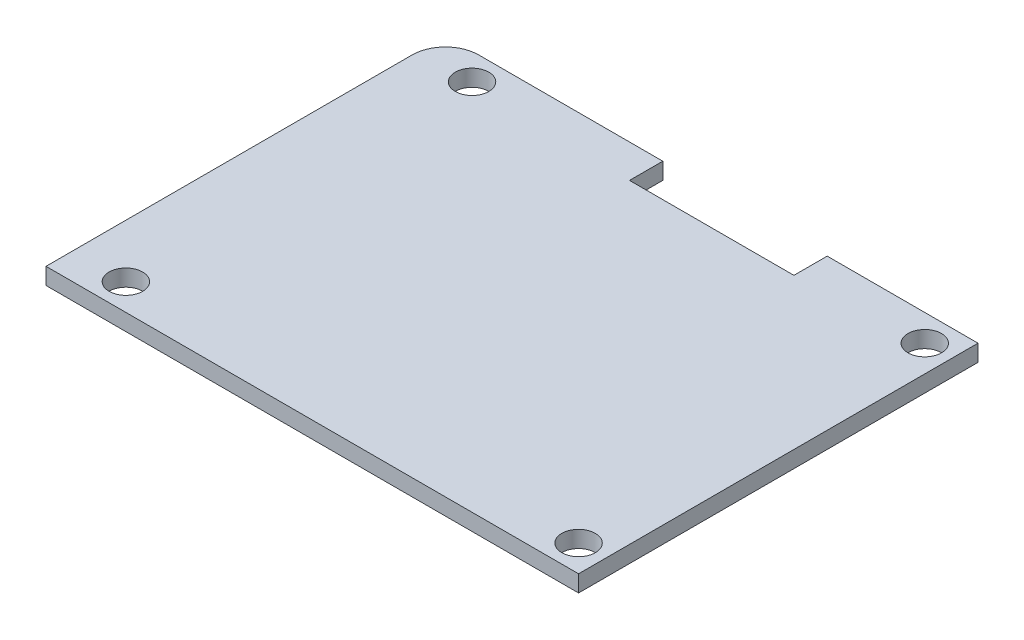
ISO-10303-21;
HEADER;
FILE_DESCRIPTION(('STEP AP214'),'2;1');
FILE_NAME('part.step','',(''),(''),'','','');
FILE_SCHEMA(('AUTOMOTIVE_DESIGN { 1 0 10303 214 1 1 1 1 }'));
ENDSEC;
DATA;
#1=APPLICATION_CONTEXT('core data for automotive mechanical design processes');
#2=APPLICATION_PROTOCOL_DEFINITION('international standard','automotive_design',2000,#1);
#3=PRODUCT_CONTEXT('',#1,'mechanical');
#4=PRODUCT('Part','Part','',(#3));
#5=PRODUCT_RELATED_PRODUCT_CATEGORY('part','',(#4));
#6=PRODUCT_DEFINITION_FORMATION('','',#4);
#7=PRODUCT_DEFINITION_CONTEXT('part definition',#1,'design');
#8=PRODUCT_DEFINITION('design','',#6,#7);
#9=PRODUCT_DEFINITION_SHAPE('','',#8);
#10=(LENGTH_UNIT() NAMED_UNIT(*) SI_UNIT(.MILLI.,.METRE.));
#11=(NAMED_UNIT(*) PLANE_ANGLE_UNIT() SI_UNIT($,.RADIAN.));
#12=(NAMED_UNIT(*) SI_UNIT($,.STERADIAN.) SOLID_ANGLE_UNIT());
#13=UNCERTAINTY_MEASURE_WITH_UNIT(LENGTH_MEASURE(1.E-05),#10,'distance_accuracy_value','');
#14=(GEOMETRIC_REPRESENTATION_CONTEXT(3) GLOBAL_UNCERTAINTY_ASSIGNED_CONTEXT((#13)) GLOBAL_UNIT_ASSIGNED_CONTEXT((#10,
#11,#12)) REPRESENTATION_CONTEXT('',''));
#15=CARTESIAN_POINT('',(0.,0.,0.));
#16=DIRECTION('',(0.,0.,1.));
#17=DIRECTION('',(1.,0.,0.));
#18=AXIS2_PLACEMENT_3D('',#15,#16,#17);
#19=CARTESIAN_POINT('',(0.,1.5875,0.));
#20=DIRECTION('',(1.,0.,0.));
#21=DIRECTION('',(0.,0.,-1.));
#22=AXIS2_PLACEMENT_3D('',#19,#20,#21);
#23=PLANE('',#22);
#24=DIRECTION('',(0.,0.,1.));
#25=VECTOR('',#24,1.);
#26=CARTESIAN_POINT('',(0.,1.5875,0.));
#27=LINE('',#26,#25);
#28=CARTESIAN_POINT('',(0.,1.5875,-34.925));
#29=VERTEX_POINT('',#28);
#30=CARTESIAN_POINT('',(0.,1.5875,0.));
#31=VERTEX_POINT('',#30);
#32=EDGE_CURVE('E103',#29,#31,#27,.T.);
#33=ORIENTED_EDGE('',*,*,#32,.F.);
#34=DIRECTION('',(0.,-1.,0.));
#35=VECTOR('',#34,1.);
#36=CARTESIAN_POINT('',(0.,1.5875,-34.925));
#37=LINE('',#36,#35);
#38=CARTESIAN_POINT('',(0.,0.,-34.925));
#39=VERTEX_POINT('',#38);
#40=EDGE_CURVE('E126',#29,#39,#37,.T.);
#41=ORIENTED_EDGE('',*,*,#40,.T.);
#42=DIRECTION('',(0.,0.,1.));
#43=VECTOR('',#42,1.);
#44=CARTESIAN_POINT('',(0.,0.,0.));
#45=LINE('',#44,#43);
#46=CARTESIAN_POINT('',(0.,0.,0.));
#47=VERTEX_POINT('',#46);
#48=EDGE_CURVE('E124',#39,#47,#45,.T.);
#49=ORIENTED_EDGE('',*,*,#48,.T.);
#50=DIRECTION('',(0.,-1.,0.));
#51=VECTOR('',#50,1.);
#52=CARTESIAN_POINT('',(0.,1.5875,0.));
#53=LINE('',#52,#51);
#54=EDGE_CURVE('E118',#31,#47,#53,.T.);
#55=ORIENTED_EDGE('',*,*,#54,.F.);
#56=EDGE_LOOP('',(#33,#41,#49,#55));
#57=FACE_BOUND('',#56,.T.);
#58=ADVANCED_FACE('F33',(#57),#23,.F.);
#59=CARTESIAN_POINT('',(0.,1.5875,0.));
#60=DIRECTION('',(0.,0.,-1.));
#61=DIRECTION('',(-1.,0.,0.));
#62=AXIS2_PLACEMENT_3D('',#59,#60,#61);
#63=PLANE('',#62);
#64=DIRECTION('',(1.,0.,0.));
#65=VECTOR('',#64,1.);
#66=CARTESIAN_POINT('',(0.,0.,0.));
#67=LINE('',#66,#65);
#68=CARTESIAN_POINT('',(50.8,0.,0.));
#69=VERTEX_POINT('',#68);
#70=EDGE_CURVE('E159',#47,#69,#67,.T.);
#71=ORIENTED_EDGE('',*,*,#70,.T.);
#72=DIRECTION('',(0.,-1.,0.));
#73=VECTOR('',#72,1.);
#74=CARTESIAN_POINT('',(50.8,1.5875,0.));
#75=LINE('',#74,#73);
#76=CARTESIAN_POINT('',(50.8,1.5875,0.));
#77=VERTEX_POINT('',#76);
#78=EDGE_CURVE('E120',#77,#69,#75,.T.);
#79=ORIENTED_EDGE('',*,*,#78,.F.);
#80=DIRECTION('',(1.,0.,0.));
#81=VECTOR('',#80,1.);
#82=CARTESIAN_POINT('',(0.,1.5875,0.));
#83=LINE('',#82,#81);
#84=EDGE_CURVE('E106',#31,#77,#83,.T.);
#85=ORIENTED_EDGE('',*,*,#84,.F.);
#86=ORIENTED_EDGE('',*,*,#54,.T.);
#87=EDGE_LOOP('',(#71,#79,#85,#86));
#88=FACE_BOUND('',#87,.T.);
#89=ADVANCED_FACE('F117',(#88),#63,.F.);
#90=CARTESIAN_POINT('',(50.8,1.5875,0.));
#91=DIRECTION('',(-1.,0.,0.));
#92=DIRECTION('',(0.,0.,1.));
#93=AXIS2_PLACEMENT_3D('',#90,#91,#92);
#94=PLANE('',#93);
#95=DIRECTION('',(0.,0.,-1.));
#96=VECTOR('',#95,1.);
#97=CARTESIAN_POINT('',(50.8,0.,0.));
#98=LINE('',#97,#96);
#99=CARTESIAN_POINT('',(50.8,0.,-38.1));
#100=VERTEX_POINT('',#99);
#101=EDGE_CURVE('E157',#69,#100,#98,.T.);
#102=ORIENTED_EDGE('',*,*,#101,.T.);
#103=DIRECTION('',(0.,-1.,0.));
#104=VECTOR('',#103,1.);
#105=CARTESIAN_POINT('',(50.8,1.5875,-38.1));
#106=LINE('',#105,#104);
#107=CARTESIAN_POINT('',(50.8,1.5875,-38.1));
#108=VERTEX_POINT('',#107);
#109=EDGE_CURVE('E129',#108,#100,#106,.T.);
#110=ORIENTED_EDGE('',*,*,#109,.F.);
#111=DIRECTION('',(0.,0.,-1.));
#112=VECTOR('',#111,1.);
#113=CARTESIAN_POINT('',(50.8,1.5875,0.));
#114=LINE('',#113,#112);
#115=EDGE_CURVE('E122',#77,#108,#114,.T.);
#116=ORIENTED_EDGE('',*,*,#115,.F.);
#117=ORIENTED_EDGE('',*,*,#78,.T.);
#118=EDGE_LOOP('',(#102,#110,#116,#117));
#119=FACE_BOUND('',#118,.T.);
#120=ADVANCED_FACE('F234',(#119),#94,.F.);
#121=CARTESIAN_POINT('',(36.41598,1.5875,-38.1));
#122=DIRECTION('',(0.,0.,1.));
#123=DIRECTION('',(1.,0.,0.));
#124=AXIS2_PLACEMENT_3D('',#121,#122,#123);
#125=PLANE('',#124);
#126=DIRECTION('',(-1.,0.,0.));
#127=VECTOR('',#126,1.);
#128=CARTESIAN_POINT('',(36.41598,0.,-38.1));
#129=LINE('',#128,#127);
#130=CARTESIAN_POINT('',(36.41598,0.,-38.1));
#131=VERTEX_POINT('',#130);
#132=EDGE_CURVE('E155',#100,#131,#129,.T.);
#133=ORIENTED_EDGE('',*,*,#132,.T.);
#134=DIRECTION('',(0.,-1.,0.));
#135=VECTOR('',#134,1.);
#136=CARTESIAN_POINT('',(36.41598,1.5875,-38.1));
#137=LINE('',#136,#135);
#138=CARTESIAN_POINT('',(36.41598,1.5875,-38.1));
#139=VERTEX_POINT('',#138);
#140=EDGE_CURVE('E135',#139,#131,#137,.T.);
#141=ORIENTED_EDGE('',*,*,#140,.F.);
#142=DIRECTION('',(-1.,0.,0.));
#143=VECTOR('',#142,1.);
#144=CARTESIAN_POINT('',(36.41598,1.5875,-38.1));
#145=LINE('',#144,#143);
#146=EDGE_CURVE('E170',#108,#139,#145,.T.);
#147=ORIENTED_EDGE('',*,*,#146,.F.);
#148=ORIENTED_EDGE('',*,*,#109,.T.);
#149=EDGE_LOOP('',(#133,#141,#147,#148));
#150=FACE_BOUND('',#149,.T.);
#151=ADVANCED_FACE('F239',(#150),#125,.F.);
#152=CARTESIAN_POINT('',(36.41598,1.5875,-38.1));
#153=DIRECTION('',(1.,0.,0.));
#154=DIRECTION('',(0.,0.,-1.));
#155=AXIS2_PLACEMENT_3D('',#152,#153,#154);
#156=PLANE('',#155);
#157=DIRECTION('',(0.,0.,1.));
#158=VECTOR('',#157,1.);
#159=CARTESIAN_POINT('',(36.41598,0.,-38.1));
#160=LINE('',#159,#158);
#161=CARTESIAN_POINT('',(36.41598,0.,-34.925));
#162=VERTEX_POINT('',#161);
#163=EDGE_CURVE('E153',#131,#162,#160,.T.);
#164=ORIENTED_EDGE('',*,*,#163,.T.);
#165=DIRECTION('',(0.,-1.,0.));
#166=VECTOR('',#165,1.);
#167=CARTESIAN_POINT('',(36.41598,1.5875,-34.925));
#168=LINE('',#167,#166);
#169=CARTESIAN_POINT('',(36.41598,1.5875,-34.925));
#170=VERTEX_POINT('',#169);
#171=EDGE_CURVE('E138',#170,#162,#168,.T.);
#172=ORIENTED_EDGE('',*,*,#171,.F.);
#173=DIRECTION('',(0.,0.,1.));
#174=VECTOR('',#173,1.);
#175=CARTESIAN_POINT('',(36.41598,1.5875,-38.1));
#176=LINE('',#175,#174);
#177=EDGE_CURVE('E168',#139,#170,#176,.T.);
#178=ORIENTED_EDGE('',*,*,#177,.F.);
#179=ORIENTED_EDGE('',*,*,#140,.T.);
#180=EDGE_LOOP('',(#164,#172,#178,#179));
#181=FACE_BOUND('',#180,.T.);
#182=ADVANCED_FACE('F243',(#181),#156,.F.);
#183=CARTESIAN_POINT('',(20.73402,1.5875,-34.925));
#184=DIRECTION('',(0.,0.,1.));
#185=DIRECTION('',(1.,0.,0.));
#186=AXIS2_PLACEMENT_3D('',#183,#184,#185);
#187=PLANE('',#186);
#188=DIRECTION('',(-1.,0.,0.));
#189=VECTOR('',#188,1.);
#190=CARTESIAN_POINT('',(20.73402,0.,-34.925));
#191=LINE('',#190,#189);
#192=CARTESIAN_POINT('',(20.73402,0.,-34.925));
#193=VERTEX_POINT('',#192);
#194=EDGE_CURVE('E151',#162,#193,#191,.T.);
#195=ORIENTED_EDGE('',*,*,#194,.T.);
#196=DIRECTION('',(0.,-1.,0.));
#197=VECTOR('',#196,1.);
#198=CARTESIAN_POINT('',(20.73402,1.5875,-34.925));
#199=LINE('',#198,#197);
#200=CARTESIAN_POINT('',(20.73402,1.5875,-34.925));
#201=VERTEX_POINT('',#200);
#202=EDGE_CURVE('E141',#201,#193,#199,.T.);
#203=ORIENTED_EDGE('',*,*,#202,.F.);
#204=DIRECTION('',(-1.,0.,0.));
#205=VECTOR('',#204,1.);
#206=CARTESIAN_POINT('',(20.73402,1.5875,-34.925));
#207=LINE('',#206,#205);
#208=EDGE_CURVE('E166',#170,#201,#207,.T.);
#209=ORIENTED_EDGE('',*,*,#208,.F.);
#210=ORIENTED_EDGE('',*,*,#171,.T.);
#211=EDGE_LOOP('',(#195,#203,#209,#210));
#212=FACE_BOUND('',#211,.T.);
#213=ADVANCED_FACE('F247',(#212),#187,.F.);
#214=CARTESIAN_POINT('',(20.73402,1.5875,-38.1));
#215=DIRECTION('',(-1.,0.,0.));
#216=DIRECTION('',(0.,0.,1.));
#217=AXIS2_PLACEMENT_3D('',#214,#215,#216);
#218=PLANE('',#217);
#219=DIRECTION('',(0.,0.,-1.));
#220=VECTOR('',#219,1.);
#221=CARTESIAN_POINT('',(20.73402,0.,-38.1));
#222=LINE('',#221,#220);
#223=CARTESIAN_POINT('',(20.73402,0.,-38.1));
#224=VERTEX_POINT('',#223);
#225=EDGE_CURVE('E149',#193,#224,#222,.T.);
#226=ORIENTED_EDGE('',*,*,#225,.T.);
#227=DIRECTION('',(0.,-1.,0.));
#228=VECTOR('',#227,1.);
#229=CARTESIAN_POINT('',(20.73402,1.5875,-38.1));
#230=LINE('',#229,#228);
#231=CARTESIAN_POINT('',(20.73402,1.5875,-38.1));
#232=VERTEX_POINT('',#231);
#233=EDGE_CURVE('E144',#232,#224,#230,.T.);
#234=ORIENTED_EDGE('',*,*,#233,.F.);
#235=DIRECTION('',(0.,0.,-1.));
#236=VECTOR('',#235,1.);
#237=CARTESIAN_POINT('',(20.73402,1.5875,-38.1));
#238=LINE('',#237,#236);
#239=EDGE_CURVE('E164',#201,#232,#238,.T.);
#240=ORIENTED_EDGE('',*,*,#239,.F.);
#241=ORIENTED_EDGE('',*,*,#202,.T.);
#242=EDGE_LOOP('',(#226,#234,#240,#241));
#243=FACE_BOUND('',#242,.T.);
#244=ADVANCED_FACE('F251',(#243),#218,.F.);
#245=CARTESIAN_POINT('',(0.,1.5875,-38.1));
#246=DIRECTION('',(0.,0.,1.));
#247=DIRECTION('',(1.,0.,0.));
#248=AXIS2_PLACEMENT_3D('',#245,#246,#247);
#249=PLANE('',#248);
#250=DIRECTION('',(-1.,0.,0.));
#251=VECTOR('',#250,1.);
#252=CARTESIAN_POINT('',(0.,0.,-38.1));
#253=LINE('',#252,#251);
#254=CARTESIAN_POINT('',(3.175,0.,-38.1));
#255=VERTEX_POINT('',#254);
#256=EDGE_CURVE('E113',#224,#255,#253,.T.);
#257=ORIENTED_EDGE('',*,*,#256,.T.);
#258=DIRECTION('',(0.,-1.,0.));
#259=VECTOR('',#258,1.);
#260=CARTESIAN_POINT('',(3.175,1.5875,-38.1));
#261=LINE('',#260,#259);
#262=CARTESIAN_POINT('',(3.175,1.5875,-38.1));
#263=VERTEX_POINT('',#262);
#264=EDGE_CURVE('E41',#255,#263,#261,.F.);
#265=ORIENTED_EDGE('',*,*,#264,.T.);
#266=DIRECTION('',(-1.,0.,0.));
#267=VECTOR('',#266,1.);
#268=CARTESIAN_POINT('',(0.,1.5875,-38.1));
#269=LINE('',#268,#267);
#270=EDGE_CURVE('E147',#232,#263,#269,.T.);
#271=ORIENTED_EDGE('',*,*,#270,.F.);
#272=ORIENTED_EDGE('',*,*,#233,.T.);
#273=EDGE_LOOP('',(#257,#265,#271,#272));
#274=FACE_BOUND('',#273,.T.);
#275=ADVANCED_FACE('F210',(#274),#249,.F.);
#276=CARTESIAN_POINT('',(0.,1.5875,0.));
#277=DIRECTION('',(0.,-1.,0.));
#278=DIRECTION('',(0.,0.,-1.));
#279=AXIS2_PLACEMENT_3D('',#276,#277,#278);
#280=PLANE('',#279);
#281=CARTESIAN_POINT('',(5.08,1.5875,-2.54));
#282=DIRECTION('',(0.,1.,0.));
#283=DIRECTION('',(0.,0.,1.));
#284=AXIS2_PLACEMENT_3D('',#281,#282,#283);
#285=CIRCLE('',#284,1.599999975);
#286=CARTESIAN_POINT('',(5.08,1.5875,-0.940000025000001));
#287=VERTEX_POINT('',#286);
#288=EDGE_CURVE('E185',#287,#287,#285,.T.);
#289=ORIENTED_EDGE('',*,*,#288,.F.);
#290=EDGE_LOOP('',(#289));
#291=FACE_BOUND('',#290,.T.);
#292=CARTESIAN_POINT('',(48.26,1.5875,-35.56));
#293=DIRECTION('',(0.,1.,0.));
#294=DIRECTION('',(0.,0.,1.));
#295=AXIS2_PLACEMENT_3D('',#292,#293,#294);
#296=CIRCLE('',#295,1.599999975);
#297=CARTESIAN_POINT('',(48.26,1.5875,-33.960000025));
#298=VERTEX_POINT('',#297);
#299=EDGE_CURVE('E191',#298,#298,#296,.T.);
#300=ORIENTED_EDGE('',*,*,#299,.F.);
#301=EDGE_LOOP('',(#300));
#302=FACE_BOUND('',#301,.T.);
#303=CARTESIAN_POINT('',(48.26,1.5875,-2.54));
#304=DIRECTION('',(0.,1.,0.));
#305=DIRECTION('',(0.,0.,1.));
#306=AXIS2_PLACEMENT_3D('',#303,#304,#305);
#307=CIRCLE('',#306,1.599999975);
#308=CARTESIAN_POINT('',(48.26,1.5875,-0.940000025000003));
#309=VERTEX_POINT('',#308);
#310=EDGE_CURVE('E179',#309,#309,#307,.T.);
#311=ORIENTED_EDGE('',*,*,#310,.F.);
#312=EDGE_LOOP('',(#311));
#313=FACE_BOUND('',#312,.T.);
#314=CARTESIAN_POINT('',(5.08,1.5875,-35.56));
#315=DIRECTION('',(0.,1.,0.));
#316=DIRECTION('',(0.,0.,1.));
#317=AXIS2_PLACEMENT_3D('',#314,#315,#316);
#318=CIRCLE('',#317,1.599999975);
#319=CARTESIAN_POINT('',(5.08,1.5875,-33.960000025));
#320=VERTEX_POINT('',#319);
#321=EDGE_CURVE('E173',#320,#320,#318,.T.);
#322=ORIENTED_EDGE('',*,*,#321,.F.);
#323=EDGE_LOOP('',(#322));
#324=FACE_BOUND('',#323,.T.);
#325=ORIENTED_EDGE('',*,*,#270,.T.);
#326=CARTESIAN_POINT('',(3.175,1.5875,-34.925));
#327=DIRECTION('',(0.,-1.,0.));
#328=DIRECTION('',(0.,0.,-1.));
#329=AXIS2_PLACEMENT_3D('',#326,#327,#328);
#330=CIRCLE('',#329,3.175);
#331=EDGE_CURVE('E11',#263,#29,#330,.F.);
#332=ORIENTED_EDGE('',*,*,#331,.T.);
#333=ORIENTED_EDGE('',*,*,#32,.T.);
#334=ORIENTED_EDGE('',*,*,#84,.T.);
#335=ORIENTED_EDGE('',*,*,#115,.T.);
#336=ORIENTED_EDGE('',*,*,#146,.T.);
#337=ORIENTED_EDGE('',*,*,#177,.T.);
#338=ORIENTED_EDGE('',*,*,#208,.T.);
#339=ORIENTED_EDGE('',*,*,#239,.T.);
#340=EDGE_LOOP('',(#325,#332,#333,#334,#335,#336,#337,#338,#339));
#341=FACE_BOUND('',#340,.T.);
#342=ADVANCED_FACE('F105',(#291,#302,#313,#324,#341),#280,.F.);
#343=CARTESIAN_POINT('',(0.,0.,0.));
#344=DIRECTION('',(0.,-1.,0.));
#345=DIRECTION('',(0.,0.,-1.));
#346=AXIS2_PLACEMENT_3D('',#343,#344,#345);
#347=PLANE('',#346);
#348=CARTESIAN_POINT('',(5.08,0.,-2.54));
#349=DIRECTION('',(0.,1.,0.));
#350=DIRECTION('',(0.,0.,1.));
#351=AXIS2_PLACEMENT_3D('',#348,#349,#350);
#352=CIRCLE('',#351,1.599999975);
#353=CARTESIAN_POINT('',(5.08,0.,-0.940000025000001));
#354=VERTEX_POINT('',#353);
#355=EDGE_CURVE('E188',#354,#354,#352,.T.);
#356=ORIENTED_EDGE('',*,*,#355,.T.);
#357=EDGE_LOOP('',(#356));
#358=FACE_BOUND('',#357,.T.);
#359=CARTESIAN_POINT('',(48.26,0.,-35.56));
#360=DIRECTION('',(0.,1.,0.));
#361=DIRECTION('',(0.,0.,1.));
#362=AXIS2_PLACEMENT_3D('',#359,#360,#361);
#363=CIRCLE('',#362,1.599999975);
#364=CARTESIAN_POINT('',(48.26,0.,-33.960000025));
#365=VERTEX_POINT('',#364);
#366=EDGE_CURVE('E182',#365,#365,#363,.T.);
#367=ORIENTED_EDGE('',*,*,#366,.T.);
#368=EDGE_LOOP('',(#367));
#369=FACE_BOUND('',#368,.T.);
#370=CARTESIAN_POINT('',(48.26,0.,-2.54));
#371=DIRECTION('',(0.,1.,0.));
#372=DIRECTION('',(0.,0.,1.));
#373=AXIS2_PLACEMENT_3D('',#370,#371,#372);
#374=CIRCLE('',#373,1.599999975);
#375=CARTESIAN_POINT('',(48.26,0.,-0.940000025000003));
#376=VERTEX_POINT('',#375);
#377=EDGE_CURVE('E176',#376,#376,#374,.T.);
#378=ORIENTED_EDGE('',*,*,#377,.T.);
#379=EDGE_LOOP('',(#378));
#380=FACE_BOUND('',#379,.T.);
#381=CARTESIAN_POINT('',(5.08,0.,-35.56));
#382=DIRECTION('',(0.,1.,0.));
#383=DIRECTION('',(0.,0.,1.));
#384=AXIS2_PLACEMENT_3D('',#381,#382,#383);
#385=CIRCLE('',#384,1.599999975);
#386=CARTESIAN_POINT('',(5.08,0.,-33.960000025));
#387=VERTEX_POINT('',#386);
#388=EDGE_CURVE('E162',#387,#387,#385,.T.);
#389=ORIENTED_EDGE('',*,*,#388,.T.);
#390=EDGE_LOOP('',(#389));
#391=FACE_BOUND('',#390,.T.);
#392=ORIENTED_EDGE('',*,*,#48,.F.);
#393=CARTESIAN_POINT('',(3.175,0.,-34.925));
#394=DIRECTION('',(0.,-1.,0.));
#395=DIRECTION('',(0.,0.,-1.));
#396=AXIS2_PLACEMENT_3D('',#393,#394,#395);
#397=CIRCLE('',#396,3.175);
#398=EDGE_CURVE('E55',#39,#255,#397,.T.);
#399=ORIENTED_EDGE('',*,*,#398,.T.);
#400=ORIENTED_EDGE('',*,*,#256,.F.);
#401=ORIENTED_EDGE('',*,*,#225,.F.);
#402=ORIENTED_EDGE('',*,*,#194,.F.);
#403=ORIENTED_EDGE('',*,*,#163,.F.);
#404=ORIENTED_EDGE('',*,*,#132,.F.);
#405=ORIENTED_EDGE('',*,*,#101,.F.);
#406=ORIENTED_EDGE('',*,*,#70,.F.);
#407=EDGE_LOOP('',(#392,#399,#400,#401,#402,#403,#404,#405,#406));
#408=FACE_BOUND('',#407,.T.);
#409=ADVANCED_FACE('F197',(#358,#369,#380,#391,#408),#347,.T.);
#410=CARTESIAN_POINT('',(5.08,0.,-35.56));
#411=DIRECTION('',(0.,1.,0.));
#412=DIRECTION('',(0.,0.,1.));
#413=AXIS2_PLACEMENT_3D('',#410,#411,#412);
#414=CYLINDRICAL_SURFACE('',#413,1.599999975);
#415=ORIENTED_EDGE('',*,*,#388,.F.);
#416=EDGE_LOOP('',(#415));
#417=FACE_BOUND('',#416,.T.);
#418=ORIENTED_EDGE('',*,*,#321,.T.);
#419=EDGE_LOOP('',(#418));
#420=FACE_BOUND('',#419,.T.);
#421=ADVANCED_FACE('F217',(#417,#420),#414,.F.);
#422=CARTESIAN_POINT('',(48.26,0.,-2.54));
#423=DIRECTION('',(0.,1.,0.));
#424=DIRECTION('',(0.,0.,1.));
#425=AXIS2_PLACEMENT_3D('',#422,#423,#424);
#426=CYLINDRICAL_SURFACE('',#425,1.599999975);
#427=ORIENTED_EDGE('',*,*,#377,.F.);
#428=EDGE_LOOP('',(#427));
#429=FACE_BOUND('',#428,.T.);
#430=ORIENTED_EDGE('',*,*,#310,.T.);
#431=EDGE_LOOP('',(#430));
#432=FACE_BOUND('',#431,.T.);
#433=ADVANCED_FACE('F204',(#429,#432),#426,.F.);
#434=CARTESIAN_POINT('',(48.26,0.,-35.56));
#435=DIRECTION('',(0.,1.,0.));
#436=DIRECTION('',(0.,0.,1.));
#437=AXIS2_PLACEMENT_3D('',#434,#435,#436);
#438=CYLINDRICAL_SURFACE('',#437,1.599999975);
#439=ORIENTED_EDGE('',*,*,#366,.F.);
#440=EDGE_LOOP('',(#439));
#441=FACE_BOUND('',#440,.T.);
#442=ORIENTED_EDGE('',*,*,#299,.T.);
#443=EDGE_LOOP('',(#442));
#444=FACE_BOUND('',#443,.T.);
#445=ADVANCED_FACE('F200',(#441,#444),#438,.F.);
#446=CARTESIAN_POINT('',(5.08,0.,-2.54));
#447=DIRECTION('',(0.,1.,0.));
#448=DIRECTION('',(0.,0.,1.));
#449=AXIS2_PLACEMENT_3D('',#446,#447,#448);
#450=CYLINDRICAL_SURFACE('',#449,1.599999975);
#451=ORIENTED_EDGE('',*,*,#355,.F.);
#452=EDGE_LOOP('',(#451));
#453=FACE_BOUND('',#452,.T.);
#454=ORIENTED_EDGE('',*,*,#288,.T.);
#455=EDGE_LOOP('',(#454));
#456=FACE_BOUND('',#455,.T.);
#457=ADVANCED_FACE('F203',(#453,#456),#450,.F.);
#458=CARTESIAN_POINT('',(3.175,1.5875,-34.925));
#459=DIRECTION('',(0.,-1.,0.));
#460=DIRECTION('',(0.,0.,-1.));
#461=AXIS2_PLACEMENT_3D('',#458,#459,#460);
#462=CYLINDRICAL_SURFACE('',#461,3.175);
#463=ORIENTED_EDGE('',*,*,#331,.F.);
#464=ORIENTED_EDGE('',*,*,#264,.F.);
#465=ORIENTED_EDGE('',*,*,#398,.F.);
#466=ORIENTED_EDGE('',*,*,#40,.F.);
#467=EDGE_LOOP('',(#463,#464,#465,#466));
#468=FACE_BOUND('',#467,.T.);
#469=ADVANCED_FACE('F35',(#468),#462,.T.);
#470=CLOSED_SHELL('',(#58,#89,#120,#151,#182,#213,#244,#275,#342,#409,#421,#433,#445,#457,#469));
#471=MANIFOLD_SOLID_BREP('B2',#470);
#472=ADVANCED_BREP_SHAPE_REPRESENTATION('',(#18,#471),#14);
#473=SHAPE_DEFINITION_REPRESENTATION(#9,#472);
ENDSEC;
END-ISO-10303-21;
